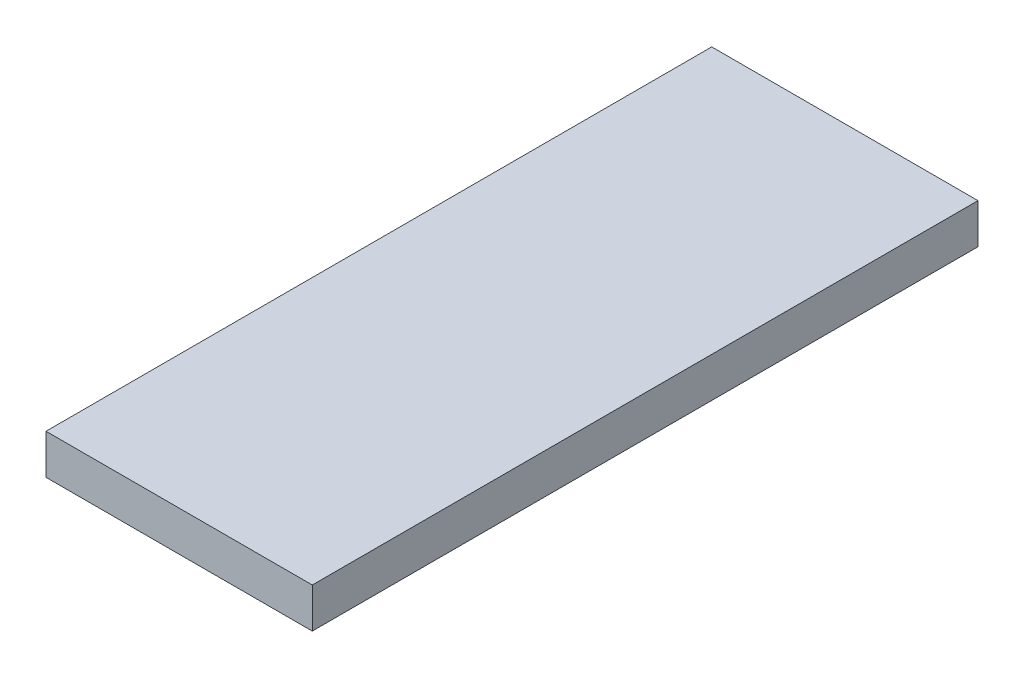
ISO-10303-21;
HEADER;
FILE_DESCRIPTION(('STEP AP214'),'2;1');
FILE_NAME('part.step','',(''),(''),'','','');
FILE_SCHEMA(('AUTOMOTIVE_DESIGN { 1 0 10303 214 1 1 1 1 }'));
ENDSEC;
DATA;
#1=APPLICATION_CONTEXT('core data for automotive mechanical design processes');
#2=APPLICATION_PROTOCOL_DEFINITION('international standard','automotive_design',2000,#1);
#3=PRODUCT_CONTEXT('',#1,'mechanical');
#4=PRODUCT('Part','Part','',(#3));
#5=PRODUCT_RELATED_PRODUCT_CATEGORY('part','',(#4));
#6=PRODUCT_DEFINITION_FORMATION('','',#4);
#7=PRODUCT_DEFINITION_CONTEXT('part definition',#1,'design');
#8=PRODUCT_DEFINITION('design','',#6,#7);
#9=PRODUCT_DEFINITION_SHAPE('','',#8);
#10=(LENGTH_UNIT() NAMED_UNIT(*) SI_UNIT(.MILLI.,.METRE.));
#11=(NAMED_UNIT(*) PLANE_ANGLE_UNIT() SI_UNIT($,.RADIAN.));
#12=(NAMED_UNIT(*) SI_UNIT($,.STERADIAN.) SOLID_ANGLE_UNIT());
#13=UNCERTAINTY_MEASURE_WITH_UNIT(LENGTH_MEASURE(1.E-05),#10,'distance_accuracy_value','');
#14=(GEOMETRIC_REPRESENTATION_CONTEXT(3) GLOBAL_UNCERTAINTY_ASSIGNED_CONTEXT((#13)) GLOBAL_UNIT_ASSIGNED_CONTEXT((#10,
#11,#12)) REPRESENTATION_CONTEXT('',''));
#15=CARTESIAN_POINT('',(0.,0.,0.));
#16=DIRECTION('',(0.,0.,1.));
#17=DIRECTION('',(1.,0.,0.));
#18=AXIS2_PLACEMENT_3D('',#15,#16,#17);
#19=CARTESIAN_POINT('',(0.,7.62,0.));
#20=DIRECTION('',(1.,0.,0.));
#21=DIRECTION('',(0.,0.,-1.));
#22=AXIS2_PLACEMENT_3D('',#19,#20,#21);
#23=PLANE('',#22);
#24=DIRECTION('',(0.,0.,1.));
#25=VECTOR('',#24,1.);
#26=CARTESIAN_POINT('',(0.,0.,0.));
#27=LINE('',#26,#25);
#28=CARTESIAN_POINT('',(0.,0.,-127.));
#29=VERTEX_POINT('',#28);
#30=CARTESIAN_POINT('',(0.,0.,0.));
#31=VERTEX_POINT('',#30);
#32=EDGE_CURVE('E95',#29,#31,#27,.T.);
#33=ORIENTED_EDGE('',*,*,#32,.T.);
#34=DIRECTION('',(0.,-1.,0.));
#35=VECTOR('',#34,1.);
#36=CARTESIAN_POINT('',(0.,7.62,0.));
#37=LINE('',#36,#35);
#38=CARTESIAN_POINT('',(0.,7.62,0.));
#39=VERTEX_POINT('',#38);
#40=EDGE_CURVE('E11',#39,#31,#37,.T.);
#41=ORIENTED_EDGE('',*,*,#40,.F.);
#42=DIRECTION('',(0.,0.,1.));
#43=VECTOR('',#42,1.);
#44=CARTESIAN_POINT('',(0.,7.62,0.));
#45=LINE('',#44,#43);
#46=CARTESIAN_POINT('',(0.,7.62,-127.));
#47=VERTEX_POINT('',#46);
#48=EDGE_CURVE('E83',#47,#39,#45,.T.);
#49=ORIENTED_EDGE('',*,*,#48,.F.);
#50=DIRECTION('',(0.,-1.,0.));
#51=VECTOR('',#50,1.);
#52=CARTESIAN_POINT('',(0.,7.62,-127.));
#53=LINE('',#52,#51);
#54=EDGE_CURVE('E91',#47,#29,#53,.T.);
#55=ORIENTED_EDGE('',*,*,#54,.T.);
#56=EDGE_LOOP('',(#33,#41,#49,#55));
#57=FACE_BOUND('',#56,.T.);
#58=ADVANCED_FACE('F32',(#57),#23,.F.);
#59=CARTESIAN_POINT('',(0.,7.62,0.));
#60=DIRECTION('',(0.,0.,-1.));
#61=DIRECTION('',(-1.,0.,0.));
#62=AXIS2_PLACEMENT_3D('',#59,#60,#61);
#63=PLANE('',#62);
#64=DIRECTION('',(1.,0.,0.));
#65=VECTOR('',#64,1.);
#66=CARTESIAN_POINT('',(0.,0.,0.));
#67=LINE('',#66,#65);
#68=CARTESIAN_POINT('',(50.8,0.,0.));
#69=VERTEX_POINT('',#68);
#70=EDGE_CURVE('E87',#31,#69,#67,.T.);
#71=ORIENTED_EDGE('',*,*,#70,.T.);
#72=DIRECTION('',(0.,-1.,0.));
#73=VECTOR('',#72,1.);
#74=CARTESIAN_POINT('',(50.8,7.62,0.));
#75=LINE('',#74,#73);
#76=CARTESIAN_POINT('',(50.8,7.62,0.));
#77=VERTEX_POINT('',#76);
#78=EDGE_CURVE('E40',#77,#69,#75,.T.);
#79=ORIENTED_EDGE('',*,*,#78,.F.);
#80=DIRECTION('',(1.,0.,0.));
#81=VECTOR('',#80,1.);
#82=CARTESIAN_POINT('',(0.,7.62,0.));
#83=LINE('',#82,#81);
#84=EDGE_CURVE('E78',#39,#77,#83,.T.);
#85=ORIENTED_EDGE('',*,*,#84,.F.);
#86=ORIENTED_EDGE('',*,*,#40,.T.);
#87=EDGE_LOOP('',(#71,#79,#85,#86));
#88=FACE_BOUND('',#87,.T.);
#89=ADVANCED_FACE('F86',(#88),#63,.F.);
#90=CARTESIAN_POINT('',(50.8,7.62,0.));
#91=DIRECTION('',(-1.,0.,0.));
#92=DIRECTION('',(0.,0.,1.));
#93=AXIS2_PLACEMENT_3D('',#90,#91,#92);
#94=PLANE('',#93);
#95=DIRECTION('',(0.,0.,-1.));
#96=VECTOR('',#95,1.);
#97=CARTESIAN_POINT('',(50.8,0.,0.));
#98=LINE('',#97,#96);
#99=CARTESIAN_POINT('',(50.8,0.,-127.));
#100=VERTEX_POINT('',#99);
#101=EDGE_CURVE('E65',#69,#100,#98,.T.);
#102=ORIENTED_EDGE('',*,*,#101,.T.);
#103=DIRECTION('',(0.,-1.,0.));
#104=VECTOR('',#103,1.);
#105=CARTESIAN_POINT('',(50.8,7.62,-127.));
#106=LINE('',#105,#104);
#107=CARTESIAN_POINT('',(50.8,7.62,-127.));
#108=VERTEX_POINT('',#107);
#109=EDGE_CURVE('E88',#108,#100,#106,.T.);
#110=ORIENTED_EDGE('',*,*,#109,.F.);
#111=DIRECTION('',(0.,0.,-1.));
#112=VECTOR('',#111,1.);
#113=CARTESIAN_POINT('',(50.8,7.62,0.));
#114=LINE('',#113,#112);
#115=EDGE_CURVE('E81',#77,#108,#114,.T.);
#116=ORIENTED_EDGE('',*,*,#115,.F.);
#117=ORIENTED_EDGE('',*,*,#78,.T.);
#118=EDGE_LOOP('',(#102,#110,#116,#117));
#119=FACE_BOUND('',#118,.T.);
#120=ADVANCED_FACE('F89',(#119),#94,.F.);
#121=CARTESIAN_POINT('',(0.,7.62,-127.));
#122=DIRECTION('',(0.,0.,1.));
#123=DIRECTION('',(1.,0.,0.));
#124=AXIS2_PLACEMENT_3D('',#121,#122,#123);
#125=PLANE('',#124);
#126=DIRECTION('',(-1.,0.,0.));
#127=VECTOR('',#126,1.);
#128=CARTESIAN_POINT('',(0.,0.,-127.));
#129=LINE('',#128,#127);
#130=EDGE_CURVE('E71',#100,#29,#129,.T.);
#131=ORIENTED_EDGE('',*,*,#130,.T.);
#132=ORIENTED_EDGE('',*,*,#54,.F.);
#133=DIRECTION('',(-1.,0.,0.));
#134=VECTOR('',#133,1.);
#135=CARTESIAN_POINT('',(0.,7.62,-127.));
#136=LINE('',#135,#134);
#137=EDGE_CURVE('E48',#108,#47,#136,.T.);
#138=ORIENTED_EDGE('',*,*,#137,.F.);
#139=ORIENTED_EDGE('',*,*,#109,.T.);
#140=EDGE_LOOP('',(#131,#132,#138,#139));
#141=FACE_BOUND('',#140,.T.);
#142=ADVANCED_FACE('F102',(#141),#125,.F.);
#143=CARTESIAN_POINT('',(0.,7.62,0.));
#144=DIRECTION('',(0.,-1.,0.));
#145=DIRECTION('',(0.,0.,-1.));
#146=AXIS2_PLACEMENT_3D('',#143,#144,#145);
#147=PLANE('',#146);
#148=ORIENTED_EDGE('',*,*,#48,.T.);
#149=ORIENTED_EDGE('',*,*,#84,.T.);
#150=ORIENTED_EDGE('',*,*,#115,.T.);
#151=ORIENTED_EDGE('',*,*,#137,.T.);
#152=EDGE_LOOP('',(#148,#149,#150,#151));
#153=FACE_BOUND('',#152,.T.);
#154=ADVANCED_FACE('F79',(#153),#147,.F.);
#155=CARTESIAN_POINT('',(0.,0.,0.));
#156=DIRECTION('',(0.,-1.,0.));
#157=DIRECTION('',(0.,0.,-1.));
#158=AXIS2_PLACEMENT_3D('',#155,#156,#157);
#159=PLANE('',#158);
#160=ORIENTED_EDGE('',*,*,#32,.F.);
#161=ORIENTED_EDGE('',*,*,#130,.F.);
#162=ORIENTED_EDGE('',*,*,#101,.F.);
#163=ORIENTED_EDGE('',*,*,#70,.F.);
#164=EDGE_LOOP('',(#160,#161,#162,#163));
#165=FACE_BOUND('',#164,.T.);
#166=ADVANCED_FACE('F105',(#165),#159,.T.);
#167=CLOSED_SHELL('',(#58,#89,#120,#142,#154,#166));
#168=MANIFOLD_SOLID_BREP('B2',#167);
#169=ADVANCED_BREP_SHAPE_REPRESENTATION('',(#18,#168),#14);
#170=SHAPE_DEFINITION_REPRESENTATION(#9,#169);
ENDSEC;
END-ISO-10303-21;
